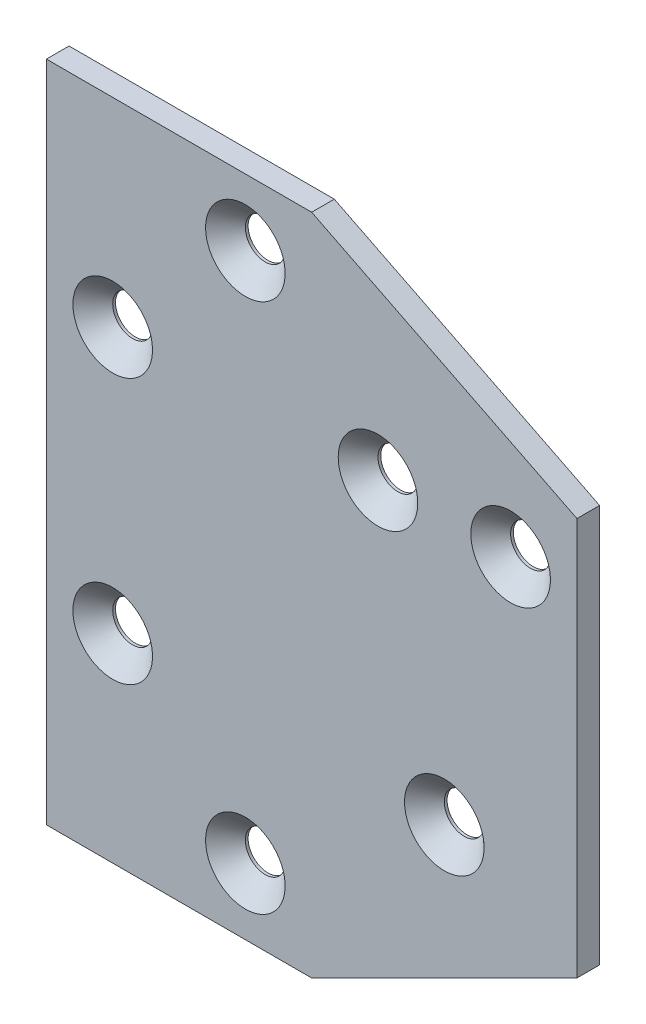
ISO-10303-21;
HEADER;
FILE_DESCRIPTION(('STEP AP214'),'2;1');
FILE_NAME('part.step','',(''),(''),'','','');
FILE_SCHEMA(('AUTOMOTIVE_DESIGN { 1 0 10303 214 1 1 1 1 }'));
ENDSEC;
DATA;
#1=APPLICATION_CONTEXT('core data for automotive mechanical design processes');
#2=APPLICATION_PROTOCOL_DEFINITION('international standard','automotive_design',2000,#1);
#3=PRODUCT_CONTEXT('',#1,'mechanical');
#4=PRODUCT('Part','Part','',(#3));
#5=PRODUCT_RELATED_PRODUCT_CATEGORY('part','',(#4));
#6=PRODUCT_DEFINITION_FORMATION('','',#4);
#7=PRODUCT_DEFINITION_CONTEXT('part definition',#1,'design');
#8=PRODUCT_DEFINITION('design','',#6,#7);
#9=PRODUCT_DEFINITION_SHAPE('','',#8);
#10=(LENGTH_UNIT() NAMED_UNIT(*) SI_UNIT(.MILLI.,.METRE.));
#11=(NAMED_UNIT(*) PLANE_ANGLE_UNIT() SI_UNIT($,.RADIAN.));
#12=(NAMED_UNIT(*) SI_UNIT($,.STERADIAN.) SOLID_ANGLE_UNIT());
#13=UNCERTAINTY_MEASURE_WITH_UNIT(LENGTH_MEASURE(1.E-05),#10,'distance_accuracy_value','');
#14=(GEOMETRIC_REPRESENTATION_CONTEXT(3) GLOBAL_UNCERTAINTY_ASSIGNED_CONTEXT((#13)) GLOBAL_UNIT_ASSIGNED_CONTEXT((#10,
#11,#12)) REPRESENTATION_CONTEXT('',''));
#15=CARTESIAN_POINT('',(0.,0.,0.));
#16=DIRECTION('',(0.,0.,1.));
#17=DIRECTION('',(1.,0.,0.));
#18=AXIS2_PLACEMENT_3D('',#15,#16,#17);
#19=CARTESIAN_POINT('',(-20.,-50.,-3.416));
#20=DIRECTION('',(-1.,0.,0.));
#21=DIRECTION('',(0.,0.,-1.));
#22=AXIS2_PLACEMENT_3D('',#19,#20,#21);
#23=PLANE('',#22);
#24=DIRECTION('',(0.,1.,0.));
#25=VECTOR('',#24,1.);
#26=CARTESIAN_POINT('',(-20.,-50.,0.));
#27=LINE('',#26,#25);
#28=CARTESIAN_POINT('',(-20.,-50.,0.));
#29=VERTEX_POINT('',#28);
#30=CARTESIAN_POINT('',(-20.,50.,0.));
#31=VERTEX_POINT('',#30);
#32=EDGE_CURVE('E127',#29,#31,#27,.T.);
#33=ORIENTED_EDGE('',*,*,#32,.T.);
#34=DIRECTION('',(0.,0.,1.));
#35=VECTOR('',#34,1.);
#36=CARTESIAN_POINT('',(-20.,50.,-3.416));
#37=LINE('',#36,#35);
#38=CARTESIAN_POINT('',(-20.,50.,-3.416));
#39=VERTEX_POINT('',#38);
#40=EDGE_CURVE('E123',#39,#31,#37,.T.);
#41=ORIENTED_EDGE('',*,*,#40,.F.);
#42=DIRECTION('',(0.,1.,0.));
#43=VECTOR('',#42,1.);
#44=CARTESIAN_POINT('',(-20.,-50.,-3.416));
#45=LINE('',#44,#43);
#46=CARTESIAN_POINT('',(-20.,-50.,-3.416));
#47=VERTEX_POINT('',#46);
#48=EDGE_CURVE('E138',#47,#39,#45,.T.);
#49=ORIENTED_EDGE('',*,*,#48,.F.);
#50=DIRECTION('',(0.,0.,1.));
#51=VECTOR('',#50,1.);
#52=CARTESIAN_POINT('',(-20.,-50.,-3.416));
#53=LINE('',#52,#51);
#54=EDGE_CURVE('E139',#47,#29,#53,.T.);
#55=ORIENTED_EDGE('',*,*,#54,.T.);
#56=EDGE_LOOP('',(#33,#41,#49,#55));
#57=FACE_BOUND('',#56,.T.);
#58=ADVANCED_FACE('F41',(#57),#23,.T.);
#59=CARTESIAN_POINT('',(-20.,-50.,-3.416));
#60=DIRECTION('',(0.,1.,0.));
#61=DIRECTION('',(0.,0.,-1.));
#62=AXIS2_PLACEMENT_3D('',#59,#60,#61);
#63=PLANE('',#62);
#64=DIRECTION('',(1.,0.,0.));
#65=VECTOR('',#64,1.);
#66=CARTESIAN_POINT('',(-20.,-50.,0.));
#67=LINE('',#66,#65);
#68=CARTESIAN_POINT('',(20.,-50.,0.));
#69=VERTEX_POINT('',#68);
#70=EDGE_CURVE('E87',#29,#69,#67,.T.);
#71=ORIENTED_EDGE('',*,*,#70,.F.);
#72=ORIENTED_EDGE('',*,*,#54,.F.);
#73=DIRECTION('',(1.,0.,0.));
#74=VECTOR('',#73,1.);
#75=CARTESIAN_POINT('',(-20.,-50.,-3.416));
#76=LINE('',#75,#74);
#77=CARTESIAN_POINT('',(20.,-50.,-3.416));
#78=VERTEX_POINT('',#77);
#79=EDGE_CURVE('E58',#47,#78,#76,.T.);
#80=ORIENTED_EDGE('',*,*,#79,.T.);
#81=DIRECTION('',(0.,0.,1.));
#82=VECTOR('',#81,1.);
#83=CARTESIAN_POINT('',(20.,-50.,-3.416));
#84=LINE('',#83,#82);
#85=EDGE_CURVE('E118',#78,#69,#84,.T.);
#86=ORIENTED_EDGE('',*,*,#85,.T.);
#87=EDGE_LOOP('',(#71,#72,#80,#86));
#88=FACE_BOUND('',#87,.T.);
#89=ADVANCED_FACE('F221',(#88),#63,.F.);
#90=CARTESIAN_POINT('',(60.,-30.,-3.416));
#91=DIRECTION('',(0.447213595499958,-0.894427190999916,0.));
#92=DIRECTION('',(0.894427190999916,0.447213595499958,0.));
#93=AXIS2_PLACEMENT_3D('',#90,#91,#92);
#94=PLANE('',#93);
#95=DIRECTION('',(-0.894427190999916,-0.447213595499958,0.));
#96=VECTOR('',#95,1.);
#97=CARTESIAN_POINT('',(60.,-30.,0.));
#98=LINE('',#97,#96);
#99=CARTESIAN_POINT('',(60.,-30.,0.));
#100=VERTEX_POINT('',#99);
#101=EDGE_CURVE('E81',#100,#69,#98,.T.);
#102=ORIENTED_EDGE('',*,*,#101,.T.);
#103=ORIENTED_EDGE('',*,*,#85,.F.);
#104=DIRECTION('',(-0.894427190999916,-0.447213595499958,0.));
#105=VECTOR('',#104,1.);
#106=CARTESIAN_POINT('',(60.,-30.,-3.416));
#107=LINE('',#106,#105);
#108=CARTESIAN_POINT('',(60.,-30.,-3.416));
#109=VERTEX_POINT('',#108);
#110=EDGE_CURVE('E107',#109,#78,#107,.T.);
#111=ORIENTED_EDGE('',*,*,#110,.F.);
#112=DIRECTION('',(0.,0.,1.));
#113=VECTOR('',#112,1.);
#114=CARTESIAN_POINT('',(60.,-30.,-3.416));
#115=LINE('',#114,#113);
#116=EDGE_CURVE('E114',#109,#100,#115,.T.);
#117=ORIENTED_EDGE('',*,*,#116,.T.);
#118=EDGE_LOOP('',(#102,#103,#111,#117));
#119=FACE_BOUND('',#118,.T.);
#120=ADVANCED_FACE('F121',(#119),#94,.T.);
#121=CARTESIAN_POINT('',(60.,-30.,-3.416));
#122=DIRECTION('',(-1.,0.,0.));
#123=DIRECTION('',(0.,0.,-1.));
#124=AXIS2_PLACEMENT_3D('',#121,#122,#123);
#125=PLANE('',#124);
#126=DIRECTION('',(0.,1.,0.));
#127=VECTOR('',#126,1.);
#128=CARTESIAN_POINT('',(60.,-30.,0.));
#129=LINE('',#128,#127);
#130=CARTESIAN_POINT('',(60.,30.,0.));
#131=VERTEX_POINT('',#130);
#132=EDGE_CURVE('E117',#100,#131,#129,.T.);
#133=ORIENTED_EDGE('',*,*,#132,.F.);
#134=ORIENTED_EDGE('',*,*,#116,.F.);
#135=DIRECTION('',(0.,1.,0.));
#136=VECTOR('',#135,1.);
#137=CARTESIAN_POINT('',(60.,-30.,-3.416));
#138=LINE('',#137,#136);
#139=CARTESIAN_POINT('',(60.,30.,-3.416));
#140=VERTEX_POINT('',#139);
#141=EDGE_CURVE('E103',#109,#140,#138,.T.);
#142=ORIENTED_EDGE('',*,*,#141,.T.);
#143=DIRECTION('',(0.,0.,1.));
#144=VECTOR('',#143,1.);
#145=CARTESIAN_POINT('',(60.,30.,-3.416));
#146=LINE('',#145,#144);
#147=EDGE_CURVE('E119',#140,#131,#146,.T.);
#148=ORIENTED_EDGE('',*,*,#147,.T.);
#149=EDGE_LOOP('',(#133,#134,#142,#148));
#150=FACE_BOUND('',#149,.T.);
#151=ADVANCED_FACE('F115',(#150),#125,.F.);
#152=CARTESIAN_POINT('',(20.,50.,-3.416));
#153=DIRECTION('',(0.447213595499958,0.894427190999916,0.));
#154=DIRECTION('',(-0.894427190999916,0.447213595499958,0.));
#155=AXIS2_PLACEMENT_3D('',#152,#153,#154);
#156=PLANE('',#155);
#157=DIRECTION('',(0.894427190999916,-0.447213595499958,0.));
#158=VECTOR('',#157,1.);
#159=CARTESIAN_POINT('',(20.,50.,0.));
#160=LINE('',#159,#158);
#161=CARTESIAN_POINT('',(20.,50.,0.));
#162=VERTEX_POINT('',#161);
#163=EDGE_CURVE('E133',#162,#131,#160,.T.);
#164=ORIENTED_EDGE('',*,*,#163,.T.);
#165=ORIENTED_EDGE('',*,*,#147,.F.);
#166=DIRECTION('',(0.894427190999916,-0.447213595499958,0.));
#167=VECTOR('',#166,1.);
#168=CARTESIAN_POINT('',(20.,50.,-3.416));
#169=LINE('',#168,#167);
#170=CARTESIAN_POINT('',(20.,50.,-3.416));
#171=VERTEX_POINT('',#170);
#172=EDGE_CURVE('E109',#171,#140,#169,.T.);
#173=ORIENTED_EDGE('',*,*,#172,.F.);
#174=DIRECTION('',(0.,0.,1.));
#175=VECTOR('',#174,1.);
#176=CARTESIAN_POINT('',(20.,50.,-3.416));
#177=LINE('',#176,#175);
#178=EDGE_CURVE('E144',#171,#162,#177,.T.);
#179=ORIENTED_EDGE('',*,*,#178,.T.);
#180=EDGE_LOOP('',(#164,#165,#173,#179));
#181=FACE_BOUND('',#180,.T.);
#182=ADVANCED_FACE('F216',(#181),#156,.T.);
#183=CARTESIAN_POINT('',(-20.,50.,-3.416));
#184=DIRECTION('',(0.,1.,0.));
#185=DIRECTION('',(0.,0.,-1.));
#186=AXIS2_PLACEMENT_3D('',#183,#184,#185);
#187=PLANE('',#186);
#188=DIRECTION('',(1.,0.,0.));
#189=VECTOR('',#188,1.);
#190=CARTESIAN_POINT('',(-20.,50.,0.));
#191=LINE('',#190,#189);
#192=EDGE_CURVE('E130',#31,#162,#191,.T.);
#193=ORIENTED_EDGE('',*,*,#192,.T.);
#194=ORIENTED_EDGE('',*,*,#178,.F.);
#195=DIRECTION('',(1.,0.,0.));
#196=VECTOR('',#195,1.);
#197=CARTESIAN_POINT('',(-20.,50.,-3.416));
#198=LINE('',#197,#196);
#199=EDGE_CURVE('E96',#39,#171,#198,.T.);
#200=ORIENTED_EDGE('',*,*,#199,.F.);
#201=ORIENTED_EDGE('',*,*,#40,.T.);
#202=EDGE_LOOP('',(#193,#194,#200,#201));
#203=FACE_BOUND('',#202,.T.);
#204=ADVANCED_FACE('F213',(#203),#187,.T.);
#205=CARTESIAN_POINT('',(0.,0.,-3.416));
#206=DIRECTION('',(0.,0.,1.));
#207=DIRECTION('',(-1.,0.,0.));
#208=AXIS2_PLACEMENT_3D('',#205,#206,#207);
#209=PLANE('',#208);
#210=CARTESIAN_POINT('',(-10.,-20.,-3.416));
#211=DIRECTION('',(0.,0.,1.));
#212=DIRECTION('',(-1.,0.,0.));
#213=AXIS2_PLACEMENT_3D('',#210,#211,#212);
#214=CIRCLE('',#213,3.);
#215=CARTESIAN_POINT('',(-13.,-20.,-3.416));
#216=VERTEX_POINT('',#215);
#217=EDGE_CURVE('E204',#216,#216,#214,.T.);
#218=ORIENTED_EDGE('',*,*,#217,.T.);
#219=EDGE_LOOP('',(#218));
#220=FACE_BOUND('',#219,.T.);
#221=CARTESIAN_POINT('',(50.,20.,-3.416));
#222=DIRECTION('',(0.,0.,1.));
#223=DIRECTION('',(1.,0.,0.));
#224=AXIS2_PLACEMENT_3D('',#221,#222,#223);
#225=CIRCLE('',#224,3.);
#226=CARTESIAN_POINT('',(53.,20.,-3.416));
#227=VERTEX_POINT('',#226);
#228=EDGE_CURVE('E199',#227,#227,#225,.T.);
#229=ORIENTED_EDGE('',*,*,#228,.T.);
#230=EDGE_LOOP('',(#229));
#231=FACE_BOUND('',#230,.T.);
#232=CARTESIAN_POINT('',(30.,20.,-3.416));
#233=DIRECTION('',(0.,0.,1.));
#234=DIRECTION('',(1.,0.,0.));
#235=AXIS2_PLACEMENT_3D('',#232,#233,#234);
#236=CIRCLE('',#235,3.);
#237=CARTESIAN_POINT('',(33.,20.,-3.416));
#238=VERTEX_POINT('',#237);
#239=EDGE_CURVE('E196',#238,#238,#236,.T.);
#240=ORIENTED_EDGE('',*,*,#239,.T.);
#241=EDGE_LOOP('',(#240));
#242=FACE_BOUND('',#241,.T.);
#243=CARTESIAN_POINT('',(9.99999999999999,40.,-3.416));
#244=DIRECTION('',(0.,0.,1.));
#245=DIRECTION('',(1.,0.,0.));
#246=AXIS2_PLACEMENT_3D('',#243,#244,#245);
#247=CIRCLE('',#246,3.);
#248=CARTESIAN_POINT('',(13.,40.,-3.416));
#249=VERTEX_POINT('',#248);
#250=EDGE_CURVE('E198',#249,#249,#247,.T.);
#251=ORIENTED_EDGE('',*,*,#250,.T.);
#252=EDGE_LOOP('',(#251));
#253=FACE_BOUND('',#252,.T.);
#254=CARTESIAN_POINT('',(9.99999999999999,-40.,-3.416));
#255=DIRECTION('',(0.,0.,1.));
#256=DIRECTION('',(-1.,0.,0.));
#257=AXIS2_PLACEMENT_3D('',#254,#255,#256);
#258=CIRCLE('',#257,3.);
#259=CARTESIAN_POINT('',(6.99999999999999,-40.,-3.416));
#260=VERTEX_POINT('',#259);
#261=EDGE_CURVE('E323',#260,#260,#258,.T.);
#262=ORIENTED_EDGE('',*,*,#261,.T.);
#263=EDGE_LOOP('',(#262));
#264=FACE_BOUND('',#263,.T.);
#265=CARTESIAN_POINT('',(40.,-20.,-3.416));
#266=DIRECTION('',(0.,0.,1.));
#267=DIRECTION('',(1.,0.,0.));
#268=AXIS2_PLACEMENT_3D('',#265,#266,#267);
#269=CIRCLE('',#268,3.);
#270=CARTESIAN_POINT('',(43.,-20.,-3.416));
#271=VERTEX_POINT('',#270);
#272=EDGE_CURVE('E325',#271,#271,#269,.T.);
#273=ORIENTED_EDGE('',*,*,#272,.T.);
#274=EDGE_LOOP('',(#273));
#275=FACE_BOUND('',#274,.T.);
#276=CARTESIAN_POINT('',(-10.,20.,-3.416));
#277=DIRECTION('',(0.,0.,1.));
#278=DIRECTION('',(1.,0.,0.));
#279=AXIS2_PLACEMENT_3D('',#276,#277,#278);
#280=CIRCLE('',#279,3.);
#281=CARTESIAN_POINT('',(-7.00000000000002,20.,-3.416));
#282=VERTEX_POINT('',#281);
#283=EDGE_CURVE('E131',#282,#282,#280,.T.);
#284=ORIENTED_EDGE('',*,*,#283,.T.);
#285=EDGE_LOOP('',(#284));
#286=FACE_BOUND('',#285,.T.);
#287=ORIENTED_EDGE('',*,*,#48,.T.);
#288=ORIENTED_EDGE('',*,*,#199,.T.);
#289=ORIENTED_EDGE('',*,*,#172,.T.);
#290=ORIENTED_EDGE('',*,*,#141,.F.);
#291=ORIENTED_EDGE('',*,*,#110,.T.);
#292=ORIENTED_EDGE('',*,*,#79,.F.);
#293=EDGE_LOOP('',(#287,#288,#289,#290,#291,#292));
#294=FACE_BOUND('',#293,.T.);
#295=ADVANCED_FACE('F105',(#220,#231,#242,#253,#264,#275,#286,#294),#209,.F.);
#296=CARTESIAN_POINT('',(0.,0.,0.));
#297=DIRECTION('',(0.,0.,1.));
#298=DIRECTION('',(-1.,0.,0.));
#299=AXIS2_PLACEMENT_3D('',#296,#297,#298);
#300=PLANE('',#299);
#301=CARTESIAN_POINT('',(-10.,-20.,0.));
#302=DIRECTION('',(0.,0.,-1.));
#303=DIRECTION('',(-1.,0.,0.));
#304=AXIS2_PLACEMENT_3D('',#301,#302,#303);
#305=CIRCLE('',#304,5.99999999999999);
#306=CARTESIAN_POINT('',(-16.,-20.,0.));
#307=VERTEX_POINT('',#306);
#308=EDGE_CURVE('E165',#307,#307,#305,.F.);
#309=ORIENTED_EDGE('',*,*,#308,.F.);
#310=EDGE_LOOP('',(#309));
#311=FACE_BOUND('',#310,.T.);
#312=CARTESIAN_POINT('',(9.99999999999999,-40.,0.));
#313=DIRECTION('',(0.,0.,-1.));
#314=DIRECTION('',(-1.,0.,0.));
#315=AXIS2_PLACEMENT_3D('',#312,#313,#314);
#316=CIRCLE('',#315,5.99999999999999);
#317=CARTESIAN_POINT('',(4.,-40.,0.));
#318=VERTEX_POINT('',#317);
#319=EDGE_CURVE('E162',#318,#318,#316,.F.);
#320=ORIENTED_EDGE('',*,*,#319,.F.);
#321=EDGE_LOOP('',(#320));
#322=FACE_BOUND('',#321,.T.);
#323=CARTESIAN_POINT('',(40.,-20.,0.));
#324=DIRECTION('',(0.,0.,-1.));
#325=DIRECTION('',(-1.,0.,0.));
#326=AXIS2_PLACEMENT_3D('',#323,#324,#325);
#327=CIRCLE('',#326,6.00000000000002);
#328=CARTESIAN_POINT('',(34.,-20.,0.));
#329=VERTEX_POINT('',#328);
#330=EDGE_CURVE('E159',#329,#329,#327,.F.);
#331=ORIENTED_EDGE('',*,*,#330,.F.);
#332=EDGE_LOOP('',(#331));
#333=FACE_BOUND('',#332,.T.);
#334=CARTESIAN_POINT('',(-10.,20.,0.));
#335=DIRECTION('',(0.,0.,-1.));
#336=DIRECTION('',(-1.,0.,0.));
#337=AXIS2_PLACEMENT_3D('',#334,#335,#336);
#338=CIRCLE('',#337,5.99999999999999);
#339=CARTESIAN_POINT('',(-16.,20.,0.));
#340=VERTEX_POINT('',#339);
#341=EDGE_CURVE('E156',#340,#340,#338,.F.);
#342=ORIENTED_EDGE('',*,*,#341,.F.);
#343=EDGE_LOOP('',(#342));
#344=FACE_BOUND('',#343,.T.);
#345=CARTESIAN_POINT('',(9.99999999999999,40.,0.));
#346=DIRECTION('',(0.,0.,-1.));
#347=DIRECTION('',(-1.,0.,0.));
#348=AXIS2_PLACEMENT_3D('',#345,#346,#347);
#349=CIRCLE('',#348,5.99999999999999);
#350=CARTESIAN_POINT('',(4.,40.,0.));
#351=VERTEX_POINT('',#350);
#352=EDGE_CURVE('E153',#351,#351,#349,.F.);
#353=ORIENTED_EDGE('',*,*,#352,.F.);
#354=EDGE_LOOP('',(#353));
#355=FACE_BOUND('',#354,.T.);
#356=CARTESIAN_POINT('',(30.,20.,0.));
#357=DIRECTION('',(0.,0.,-1.));
#358=DIRECTION('',(-1.,0.,0.));
#359=AXIS2_PLACEMENT_3D('',#356,#357,#358);
#360=CIRCLE('',#359,5.99999999999999);
#361=CARTESIAN_POINT('',(24.,20.,0.));
#362=VERTEX_POINT('',#361);
#363=EDGE_CURVE('E150',#362,#362,#360,.F.);
#364=ORIENTED_EDGE('',*,*,#363,.F.);
#365=EDGE_LOOP('',(#364));
#366=FACE_BOUND('',#365,.T.);
#367=CARTESIAN_POINT('',(50.,20.,0.));
#368=DIRECTION('',(0.,0.,-1.));
#369=DIRECTION('',(-1.,0.,0.));
#370=AXIS2_PLACEMENT_3D('',#367,#368,#369);
#371=CIRCLE('',#370,5.99999999999999);
#372=CARTESIAN_POINT('',(44.,20.,0.));
#373=VERTEX_POINT('',#372);
#374=EDGE_CURVE('E141',#373,#373,#371,.F.);
#375=ORIENTED_EDGE('',*,*,#374,.F.);
#376=EDGE_LOOP('',(#375));
#377=FACE_BOUND('',#376,.T.);
#378=ORIENTED_EDGE('',*,*,#32,.F.);
#379=ORIENTED_EDGE('',*,*,#70,.T.);
#380=ORIENTED_EDGE('',*,*,#101,.F.);
#381=ORIENTED_EDGE('',*,*,#132,.T.);
#382=ORIENTED_EDGE('',*,*,#163,.F.);
#383=ORIENTED_EDGE('',*,*,#192,.F.);
#384=EDGE_LOOP('',(#378,#379,#380,#381,#382,#383));
#385=FACE_BOUND('',#384,.T.);
#386=ADVANCED_FACE('F219',(#311,#322,#333,#344,#355,#366,#377,#385),#300,.T.);
#387=CARTESIAN_POINT('',(-10.,20.,0.));
#388=DIRECTION('',(0.,0.,-1.));
#389=DIRECTION('',(1.,0.,0.));
#390=AXIS2_PLACEMENT_3D('',#387,#388,#389);
#391=CYLINDRICAL_SURFACE('',#390,3.);
#392=CARTESIAN_POINT('',(-10.,20.,-2.99999999999999));
#393=DIRECTION('',(0.,0.,-1.));
#394=DIRECTION('',(-1.,0.,0.));
#395=AXIS2_PLACEMENT_3D('',#392,#393,#394);
#396=CIRCLE('',#395,3.);
#397=CARTESIAN_POINT('',(-13.,20.,-2.99999999999999));
#398=VERTEX_POINT('',#397);
#399=EDGE_CURVE('E177',#398,#398,#396,.T.);
#400=ORIENTED_EDGE('',*,*,#399,.F.);
#401=EDGE_LOOP('',(#400));
#402=FACE_BOUND('',#401,.T.);
#403=ORIENTED_EDGE('',*,*,#283,.F.);
#404=EDGE_LOOP('',(#403));
#405=FACE_BOUND('',#404,.T.);
#406=ADVANCED_FACE('F271',(#402,#405),#391,.F.);
#407=CARTESIAN_POINT('',(40.,-20.,0.));
#408=DIRECTION('',(0.,0.,-1.));
#409=DIRECTION('',(1.,0.,0.));
#410=AXIS2_PLACEMENT_3D('',#407,#408,#409);
#411=CYLINDRICAL_SURFACE('',#410,3.);
#412=CARTESIAN_POINT('',(40.,-20.,-3.00000000000004));
#413=DIRECTION('',(0.,0.,-1.));
#414=DIRECTION('',(-1.,0.,0.));
#415=AXIS2_PLACEMENT_3D('',#412,#413,#414);
#416=CIRCLE('',#415,3.);
#417=CARTESIAN_POINT('',(37.,-20.,-3.00000000000004));
#418=VERTEX_POINT('',#417);
#419=EDGE_CURVE('E174',#418,#418,#416,.T.);
#420=ORIENTED_EDGE('',*,*,#419,.F.);
#421=EDGE_LOOP('',(#420));
#422=FACE_BOUND('',#421,.T.);
#423=ORIENTED_EDGE('',*,*,#272,.F.);
#424=EDGE_LOOP('',(#423));
#425=FACE_BOUND('',#424,.T.);
#426=ADVANCED_FACE('F277',(#422,#425),#411,.F.);
#427=CARTESIAN_POINT('',(9.99999999999999,-40.,0.));
#428=DIRECTION('',(0.,0.,-1.));
#429=DIRECTION('',(1.,0.,0.));
#430=AXIS2_PLACEMENT_3D('',#427,#428,#429);
#431=CYLINDRICAL_SURFACE('',#430,3.);
#432=CARTESIAN_POINT('',(9.99999999999999,-40.,-2.99999999999999));
#433=DIRECTION('',(0.,0.,-1.));
#434=DIRECTION('',(-1.,0.,0.));
#435=AXIS2_PLACEMENT_3D('',#432,#433,#434);
#436=CIRCLE('',#435,3.);
#437=CARTESIAN_POINT('',(6.99999999999999,-40.,-2.99999999999999));
#438=VERTEX_POINT('',#437);
#439=EDGE_CURVE('E171',#438,#438,#436,.T.);
#440=ORIENTED_EDGE('',*,*,#439,.F.);
#441=EDGE_LOOP('',(#440));
#442=FACE_BOUND('',#441,.T.);
#443=ORIENTED_EDGE('',*,*,#261,.F.);
#444=EDGE_LOOP('',(#443));
#445=FACE_BOUND('',#444,.T.);
#446=ADVANCED_FACE('F304',(#442,#445),#431,.F.);
#447=CARTESIAN_POINT('',(9.99999999999999,40.,0.));
#448=DIRECTION('',(0.,0.,-1.));
#449=DIRECTION('',(1.,0.,0.));
#450=AXIS2_PLACEMENT_3D('',#447,#448,#449);
#451=CYLINDRICAL_SURFACE('',#450,3.);
#452=CARTESIAN_POINT('',(9.99999999999999,40.,-2.99999999999999));
#453=DIRECTION('',(0.,0.,-1.));
#454=DIRECTION('',(-1.,0.,0.));
#455=AXIS2_PLACEMENT_3D('',#452,#453,#454);
#456=CIRCLE('',#455,3.);
#457=CARTESIAN_POINT('',(6.99999999999999,40.,-2.99999999999999));
#458=VERTEX_POINT('',#457);
#459=EDGE_CURVE('E180',#458,#458,#456,.T.);
#460=ORIENTED_EDGE('',*,*,#459,.F.);
#461=EDGE_LOOP('',(#460));
#462=FACE_BOUND('',#461,.T.);
#463=ORIENTED_EDGE('',*,*,#250,.F.);
#464=EDGE_LOOP('',(#463));
#465=FACE_BOUND('',#464,.T.);
#466=ADVANCED_FACE('F192',(#462,#465),#451,.F.);
#467=CARTESIAN_POINT('',(30.,20.,0.));
#468=DIRECTION('',(0.,0.,-1.));
#469=DIRECTION('',(1.,0.,0.));
#470=AXIS2_PLACEMENT_3D('',#467,#468,#469);
#471=CYLINDRICAL_SURFACE('',#470,3.);
#472=CARTESIAN_POINT('',(30.,20.,-3.));
#473=DIRECTION('',(0.,0.,-1.));
#474=DIRECTION('',(-1.,0.,0.));
#475=AXIS2_PLACEMENT_3D('',#472,#473,#474);
#476=CIRCLE('',#475,3.);
#477=CARTESIAN_POINT('',(27.,20.,-3.));
#478=VERTEX_POINT('',#477);
#479=EDGE_CURVE('E50',#478,#478,#476,.T.);
#480=ORIENTED_EDGE('',*,*,#479,.F.);
#481=EDGE_LOOP('',(#480));
#482=FACE_BOUND('',#481,.T.);
#483=ORIENTED_EDGE('',*,*,#239,.F.);
#484=EDGE_LOOP('',(#483));
#485=FACE_BOUND('',#484,.T.);
#486=ADVANCED_FACE('F188',(#482,#485),#471,.F.);
#487=CARTESIAN_POINT('',(50.,20.,0.));
#488=DIRECTION('',(0.,0.,-1.));
#489=DIRECTION('',(1.,0.,0.));
#490=AXIS2_PLACEMENT_3D('',#487,#488,#489);
#491=CYLINDRICAL_SURFACE('',#490,3.);
#492=CARTESIAN_POINT('',(50.,20.,-3.));
#493=DIRECTION('',(0.,0.,-1.));
#494=DIRECTION('',(-1.,0.,0.));
#495=AXIS2_PLACEMENT_3D('',#492,#493,#494);
#496=CIRCLE('',#495,3.);
#497=CARTESIAN_POINT('',(47.,20.,-3.));
#498=VERTEX_POINT('',#497);
#499=EDGE_CURVE('E11',#498,#498,#496,.T.);
#500=ORIENTED_EDGE('',*,*,#499,.F.);
#501=EDGE_LOOP('',(#500));
#502=FACE_BOUND('',#501,.T.);
#503=ORIENTED_EDGE('',*,*,#228,.F.);
#504=EDGE_LOOP('',(#503));
#505=FACE_BOUND('',#504,.T.);
#506=ADVANCED_FACE('F191',(#502,#505),#491,.F.);
#507=CARTESIAN_POINT('',(-10.,-20.,0.));
#508=DIRECTION('',(0.,0.,-1.));
#509=DIRECTION('',(1.,0.,0.));
#510=AXIS2_PLACEMENT_3D('',#507,#508,#509);
#511=CYLINDRICAL_SURFACE('',#510,3.);
#512=CARTESIAN_POINT('',(-10.,-20.,-2.99999999999999));
#513=DIRECTION('',(0.,0.,-1.));
#514=DIRECTION('',(-1.,0.,0.));
#515=AXIS2_PLACEMENT_3D('',#512,#513,#514);
#516=CIRCLE('',#515,3.);
#517=CARTESIAN_POINT('',(-13.,-20.,-2.99999999999999));
#518=VERTEX_POINT('',#517);
#519=EDGE_CURVE('E168',#518,#518,#516,.T.);
#520=ORIENTED_EDGE('',*,*,#519,.F.);
#521=EDGE_LOOP('',(#520));
#522=FACE_BOUND('',#521,.T.);
#523=ORIENTED_EDGE('',*,*,#217,.F.);
#524=EDGE_LOOP('',(#523));
#525=FACE_BOUND('',#524,.T.);
#526=ADVANCED_FACE('F243',(#522,#525),#511,.F.);
#527=CARTESIAN_POINT('',(-10.,-20.,0.));
#528=DIRECTION('',(0.,0.,1.));
#529=DIRECTION('',(-1.,0.,0.));
#530=AXIS2_PLACEMENT_3D('',#527,#528,#529);
#531=CONICAL_SURFACE('',#530,5.99999999999999,0.785398163397448);
#532=ORIENTED_EDGE('',*,*,#519,.T.);
#533=EDGE_LOOP('',(#532));
#534=FACE_BOUND('',#533,.T.);
#535=ORIENTED_EDGE('',*,*,#308,.T.);
#536=EDGE_LOOP('',(#535));
#537=FACE_BOUND('',#536,.T.);
#538=ADVANCED_FACE('F239',(#534,#537),#531,.F.);
#539=CARTESIAN_POINT('',(9.99999999999999,-40.,0.));
#540=DIRECTION('',(0.,0.,1.));
#541=DIRECTION('',(-1.,0.,0.));
#542=AXIS2_PLACEMENT_3D('',#539,#540,#541);
#543=CONICAL_SURFACE('',#542,5.99999999999999,0.785398163397448);
#544=ORIENTED_EDGE('',*,*,#439,.T.);
#545=EDGE_LOOP('',(#544));
#546=FACE_BOUND('',#545,.T.);
#547=ORIENTED_EDGE('',*,*,#319,.T.);
#548=EDGE_LOOP('',(#547));
#549=FACE_BOUND('',#548,.T.);
#550=ADVANCED_FACE('F242',(#546,#549),#543,.F.);
#551=CARTESIAN_POINT('',(40.,-20.,0.));
#552=DIRECTION('',(0.,0.,1.));
#553=DIRECTION('',(-1.,0.,0.));
#554=AXIS2_PLACEMENT_3D('',#551,#552,#553);
#555=CONICAL_SURFACE('',#554,6.00000000000002,0.785398163397444);
#556=ORIENTED_EDGE('',*,*,#419,.T.);
#557=EDGE_LOOP('',(#556));
#558=FACE_BOUND('',#557,.T.);
#559=ORIENTED_EDGE('',*,*,#330,.T.);
#560=EDGE_LOOP('',(#559));
#561=FACE_BOUND('',#560,.T.);
#562=ADVANCED_FACE('F247',(#558,#561),#555,.F.);
#563=CARTESIAN_POINT('',(-10.,20.,0.));
#564=DIRECTION('',(0.,0.,1.));
#565=DIRECTION('',(-1.,0.,0.));
#566=AXIS2_PLACEMENT_3D('',#563,#564,#565);
#567=CONICAL_SURFACE('',#566,5.99999999999999,0.785398163397448);
#568=ORIENTED_EDGE('',*,*,#399,.T.);
#569=EDGE_LOOP('',(#568));
#570=FACE_BOUND('',#569,.T.);
#571=ORIENTED_EDGE('',*,*,#341,.T.);
#572=EDGE_LOOP('',(#571));
#573=FACE_BOUND('',#572,.T.);
#574=ADVANCED_FACE('F251',(#570,#573),#567,.F.);
#575=CARTESIAN_POINT('',(9.99999999999999,40.,0.));
#576=DIRECTION('',(0.,0.,1.));
#577=DIRECTION('',(-1.,0.,0.));
#578=AXIS2_PLACEMENT_3D('',#575,#576,#577);
#579=CONICAL_SURFACE('',#578,5.99999999999999,0.785398163397448);
#580=ORIENTED_EDGE('',*,*,#459,.T.);
#581=EDGE_LOOP('',(#580));
#582=FACE_BOUND('',#581,.T.);
#583=ORIENTED_EDGE('',*,*,#352,.T.);
#584=EDGE_LOOP('',(#583));
#585=FACE_BOUND('',#584,.T.);
#586=ADVANCED_FACE('F255',(#582,#585),#579,.F.);
#587=CARTESIAN_POINT('',(30.,20.,0.));
#588=DIRECTION('',(0.,0.,1.));
#589=DIRECTION('',(-1.,0.,0.));
#590=AXIS2_PLACEMENT_3D('',#587,#588,#589);
#591=CONICAL_SURFACE('',#590,5.99999999999999,0.785398163397448);
#592=CARTESIAN_POINT('',(27.,20.,-3.));
#593=CARTESIAN_POINT('',(26.96875,20.,-2.96875));
#594=CARTESIAN_POINT('',(26.9375,20.,-2.9375));
#595=CARTESIAN_POINT('',(26.875,20.,-2.875));
#596=CARTESIAN_POINT('',(26.84375,20.,-2.84375));
#597=CARTESIAN_POINT('',(26.78125,20.,-2.78125));
#598=CARTESIAN_POINT('',(26.75,20.,-2.75));
#599=CARTESIAN_POINT('',(26.6875,20.,-2.6875));
#600=CARTESIAN_POINT('',(26.65625,20.,-2.65625));
#601=CARTESIAN_POINT('',(26.59375,20.,-2.59375));
#602=CARTESIAN_POINT('',(26.5625,20.,-2.5625));
#603=CARTESIAN_POINT('',(26.5,20.,-2.5));
#604=CARTESIAN_POINT('',(26.46875,20.,-2.46875));
#605=CARTESIAN_POINT('',(26.40625,20.,-2.40625));
#606=CARTESIAN_POINT('',(26.375,20.,-2.375));
#607=CARTESIAN_POINT('',(26.3125,20.,-2.3125));
#608=CARTESIAN_POINT('',(26.28125,20.,-2.28125));
#609=CARTESIAN_POINT('',(26.21875,20.,-2.21875));
#610=CARTESIAN_POINT('',(26.1875,20.,-2.1875));
#611=CARTESIAN_POINT('',(26.125,20.,-2.125));
#612=CARTESIAN_POINT('',(26.09375,20.,-2.09375));
#613=CARTESIAN_POINT('',(26.03125,20.,-2.03125));
#614=CARTESIAN_POINT('',(26.,20.,-2.));
#615=CARTESIAN_POINT('',(25.9375,20.,-1.9375));
#616=CARTESIAN_POINT('',(25.90625,20.,-1.90625));
#617=CARTESIAN_POINT('',(25.84375,20.,-1.84375));
#618=CARTESIAN_POINT('',(25.8125,20.,-1.8125));
#619=CARTESIAN_POINT('',(25.75,20.,-1.75));
#620=CARTESIAN_POINT('',(25.71875,20.,-1.71875));
#621=CARTESIAN_POINT('',(25.65625,20.,-1.65625));
#622=CARTESIAN_POINT('',(25.625,20.,-1.625));
#623=CARTESIAN_POINT('',(25.5625,20.,-1.5625));
#624=CARTESIAN_POINT('',(25.53125,20.,-1.53125));
#625=CARTESIAN_POINT('',(25.46875,20.,-1.46875));
#626=CARTESIAN_POINT('',(25.4375,20.,-1.4375));
#627=CARTESIAN_POINT('',(25.375,20.,-1.375));
#628=CARTESIAN_POINT('',(25.34375,20.,-1.34375));
#629=CARTESIAN_POINT('',(25.28125,20.,-1.28125));
#630=CARTESIAN_POINT('',(25.25,20.,-1.25));
#631=CARTESIAN_POINT('',(25.1875,20.,-1.1875));
#632=CARTESIAN_POINT('',(25.15625,20.,-1.15625));
#633=CARTESIAN_POINT('',(25.09375,20.,-1.09375));
#634=CARTESIAN_POINT('',(25.0625,20.,-1.0625));
#635=CARTESIAN_POINT('',(25.,20.,-1.));
#636=CARTESIAN_POINT('',(24.96875,20.,-0.968749999999999));
#637=CARTESIAN_POINT('',(24.90625,20.,-0.906249999999999));
#638=CARTESIAN_POINT('',(24.875,20.,-0.875));
#639=CARTESIAN_POINT('',(24.8125,20.,-0.8125));
#640=CARTESIAN_POINT('',(24.78125,20.,-0.78125));
#641=CARTESIAN_POINT('',(24.71875,20.,-0.718749999999999));
#642=CARTESIAN_POINT('',(24.6875,20.,-0.6875));
#643=CARTESIAN_POINT('',(24.625,20.,-0.625));
#644=CARTESIAN_POINT('',(24.59375,20.,-0.59375));
#645=CARTESIAN_POINT('',(24.53125,20.,-0.531249999999999));
#646=CARTESIAN_POINT('',(24.5,20.,-0.499999999999999));
#647=CARTESIAN_POINT('',(24.4375,20.,-0.4375));
#648=CARTESIAN_POINT('',(24.40625,20.,-0.40625));
#649=CARTESIAN_POINT('',(24.34375,20.,-0.34375));
#650=CARTESIAN_POINT('',(24.3125,20.,-0.3125));
#651=CARTESIAN_POINT('',(24.25,20.,-0.25));
#652=CARTESIAN_POINT('',(24.21875,20.,-0.21875));
#653=CARTESIAN_POINT('',(24.15625,20.,-0.15625));
#654=CARTESIAN_POINT('',(24.125,20.,-0.125));
#655=CARTESIAN_POINT('',(24.0625,20.,-0.0625000000000001));
#656=CARTESIAN_POINT('',(24.03125,20.,-0.0312500000000002));
#657=CARTESIAN_POINT('',(24.,20.,0.));
#658=B_SPLINE_CURVE_WITH_KNOTS('',3,(#592,#593,#594,#595,#596,#597,#598,#599,#600,#601,#602,
#603,#604,#605,#606,#607,#608,#609,#610,#611,#612,#613,#614,#615,#616,#617,#618,#619,#620,#621,
#622,#623,#624,#625,#626,#627,#628,#629,#630,#631,#632,#633,#634,#635,#636,#637,#638,#639,#640,
#641,#642,#643,#644,#645,#646,#647,#648,#649,#650,#651,#652,#653,#654,#655,#656,#657),
.UNSPECIFIED.,.F.,.F.,(4,2,2,2,2,2,2,2,2,2,2,2,2,2,2,2,2,2,2,2,2,2,2,2,2,2,2,2,2,2,2,2,4),(0.,
0.132582521472478,0.265165042944955,0.397747564417433,0.530330085889911,0.662912607362388,
0.795495128834866,0.928077650307344,1.06066017177982,1.1932426932523,1.32582521472478,
1.45840773619725,1.59099025766973,1.72357277914221,1.85615530061469,1.98873782208717,
2.12132034355964,2.25390286503212,2.3864853865046,2.51906790797708,2.65165042944955,
2.78423295092203,2.91681547239451,3.04939799386699,3.18198051533946,3.31456303681194,
3.44714555828442,3.5797280797569,3.71231060122937,3.84489312270185,3.97747564417433,
4.11005816564681,4.24264068711928),.UNSPECIFIED.);
#659=EDGE_CURVE('BSEAM185',#478,#362,#658,.T.);
#660=ORIENTED_EDGE('',*,*,#479,.T.);
#661=ORIENTED_EDGE('',*,*,#363,.T.);
#662=ORIENTED_EDGE('',*,*,#659,.T.);
#663=ORIENTED_EDGE('',*,*,#659,.F.);
#664=EDGE_LOOP('',(#660,#662,#661,#663));
#665=FACE_BOUND('',#664,.T.);
#666=ADVANCED_FACE('F185',(#665),#591,.F.);
#667=CARTESIAN_POINT('',(50.,20.,0.));
#668=DIRECTION('',(0.,0.,1.));
#669=DIRECTION('',(-1.,0.,0.));
#670=AXIS2_PLACEMENT_3D('',#667,#668,#669);
#671=CONICAL_SURFACE('',#670,5.99999999999999,0.785398163397447);
#672=CARTESIAN_POINT('',(47.,20.,-3.));
#673=CARTESIAN_POINT('',(46.96875,20.,-2.96875));
#674=CARTESIAN_POINT('',(46.9375,20.,-2.9375));
#675=CARTESIAN_POINT('',(46.875,20.,-2.875));
#676=CARTESIAN_POINT('',(46.84375,20.,-2.84375));
#677=CARTESIAN_POINT('',(46.78125,20.,-2.78125));
#678=CARTESIAN_POINT('',(46.75,20.,-2.75));
#679=CARTESIAN_POINT('',(46.6875,20.,-2.6875));
#680=CARTESIAN_POINT('',(46.65625,20.,-2.65625));
#681=CARTESIAN_POINT('',(46.59375,20.,-2.59375));
#682=CARTESIAN_POINT('',(46.5625,20.,-2.5625));
#683=CARTESIAN_POINT('',(46.5,20.,-2.5));
#684=CARTESIAN_POINT('',(46.46875,20.,-2.46875));
#685=CARTESIAN_POINT('',(46.40625,20.,-2.40625));
#686=CARTESIAN_POINT('',(46.375,20.,-2.375));
#687=CARTESIAN_POINT('',(46.3125,20.,-2.3125));
#688=CARTESIAN_POINT('',(46.28125,20.,-2.28125));
#689=CARTESIAN_POINT('',(46.21875,20.,-2.21875));
#690=CARTESIAN_POINT('',(46.1875,20.,-2.1875));
#691=CARTESIAN_POINT('',(46.125,20.,-2.125));
#692=CARTESIAN_POINT('',(46.09375,20.,-2.09375));
#693=CARTESIAN_POINT('',(46.03125,20.,-2.03125));
#694=CARTESIAN_POINT('',(46.,20.,-2.));
#695=CARTESIAN_POINT('',(45.9375,20.,-1.9375));
#696=CARTESIAN_POINT('',(45.90625,20.,-1.90625));
#697=CARTESIAN_POINT('',(45.84375,20.,-1.84375));
#698=CARTESIAN_POINT('',(45.8125,20.,-1.8125));
#699=CARTESIAN_POINT('',(45.75,20.,-1.75));
#700=CARTESIAN_POINT('',(45.71875,20.,-1.71875));
#701=CARTESIAN_POINT('',(45.65625,20.,-1.65625));
#702=CARTESIAN_POINT('',(45.625,20.,-1.625));
#703=CARTESIAN_POINT('',(45.5625,20.,-1.5625));
#704=CARTESIAN_POINT('',(45.53125,20.,-1.53125));
#705=CARTESIAN_POINT('',(45.46875,20.,-1.46875));
#706=CARTESIAN_POINT('',(45.4375,20.,-1.4375));
#707=CARTESIAN_POINT('',(45.375,20.,-1.375));
#708=CARTESIAN_POINT('',(45.34375,20.,-1.34375));
#709=CARTESIAN_POINT('',(45.28125,20.,-1.28125));
#710=CARTESIAN_POINT('',(45.25,20.,-1.25));
#711=CARTESIAN_POINT('',(45.1875,20.,-1.1875));
#712=CARTESIAN_POINT('',(45.15625,20.,-1.15625));
#713=CARTESIAN_POINT('',(45.09375,20.,-1.09375));
#714=CARTESIAN_POINT('',(45.0625,20.,-1.0625));
#715=CARTESIAN_POINT('',(45.,20.,-1.));
#716=CARTESIAN_POINT('',(44.96875,20.,-0.968750000000001));
#717=CARTESIAN_POINT('',(44.90625,20.,-0.906250000000001));
#718=CARTESIAN_POINT('',(44.875,20.,-0.875000000000001));
#719=CARTESIAN_POINT('',(44.8125,20.,-0.8125));
#720=CARTESIAN_POINT('',(44.78125,20.,-0.781249999999999));
#721=CARTESIAN_POINT('',(44.71875,20.,-0.71875));
#722=CARTESIAN_POINT('',(44.6875,20.,-0.687500000000001));
#723=CARTESIAN_POINT('',(44.625,20.,-0.625000000000001));
#724=CARTESIAN_POINT('',(44.59375,20.,-0.593749999999999));
#725=CARTESIAN_POINT('',(44.53125,20.,-0.531249999999999));
#726=CARTESIAN_POINT('',(44.5,20.,-0.5));
#727=CARTESIAN_POINT('',(44.4375,20.,-0.437500000000001));
#728=CARTESIAN_POINT('',(44.40625,20.,-0.40625));
#729=CARTESIAN_POINT('',(44.34375,20.,-0.34375));
#730=CARTESIAN_POINT('',(44.3125,20.,-0.312500000000001));
#731=CARTESIAN_POINT('',(44.25,20.,-0.250000000000001));
#732=CARTESIAN_POINT('',(44.21875,20.,-0.21875));
#733=CARTESIAN_POINT('',(44.15625,20.,-0.15625));
#734=CARTESIAN_POINT('',(44.125,20.,-0.125));
#735=CARTESIAN_POINT('',(44.0625,20.,-0.0624999999999993));
#736=CARTESIAN_POINT('',(44.03125,20.,-0.0312499999999992));
#737=CARTESIAN_POINT('',(44.,20.,0.));
#738=B_SPLINE_CURVE_WITH_KNOTS('',3,(#672,#673,#674,#675,#676,#677,#678,#679,#680,#681,#682,
#683,#684,#685,#686,#687,#688,#689,#690,#691,#692,#693,#694,#695,#696,#697,#698,#699,#700,#701,
#702,#703,#704,#705,#706,#707,#708,#709,#710,#711,#712,#713,#714,#715,#716,#717,#718,#719,#720,
#721,#722,#723,#724,#725,#726,#727,#728,#729,#730,#731,#732,#733,#734,#735,#736,#737),
.UNSPECIFIED.,.F.,.F.,(4,2,2,2,2,2,2,2,2,2,2,2,2,2,2,2,2,2,2,2,2,2,2,2,2,2,2,2,2,2,2,2,4),(0.,
0.132582521472475,0.265165042944956,0.397747564417431,0.530330085889911,0.662912607362386,
0.795495128834862,0.928077650307342,1.06066017177982,1.1932426932523,1.32582521472477,
1.45840773619725,1.59099025766973,1.72357277914221,1.85615530061468,1.98873782208716,
2.12132034355964,2.25390286503211,2.38648538650459,2.51906790797707,2.65165042944955,
2.78423295092202,2.91681547239451,3.04939799386698,3.18198051533946,3.31456303681194,
3.44714555828441,3.57972807975689,3.71231060122937,3.84489312270185,3.97747564417432,
4.1100581656468,4.24264068711928),.UNSPECIFIED.);
#739=EDGE_CURVE('BSEAM43',#498,#373,#738,.T.);
#740=ORIENTED_EDGE('',*,*,#499,.T.);
#741=ORIENTED_EDGE('',*,*,#374,.T.);
#742=ORIENTED_EDGE('',*,*,#739,.T.);
#743=ORIENTED_EDGE('',*,*,#739,.F.);
#744=EDGE_LOOP('',(#740,#742,#741,#743));
#745=FACE_BOUND('',#744,.T.);
#746=ADVANCED_FACE('F43',(#745),#671,.F.);
#747=CLOSED_SHELL('',(#58,#89,#120,#151,#182,#204,#295,#386,#406,#426,#446,#466,#486,#506,#526,
#538,#550,#562,#574,#586,#666,#746));
#748=MANIFOLD_SOLID_BREP('B2',#747);
#749=ADVANCED_BREP_SHAPE_REPRESENTATION('',(#18,#748),#14);
#750=SHAPE_DEFINITION_REPRESENTATION(#9,#749);
ENDSEC;
END-ISO-10303-21;
